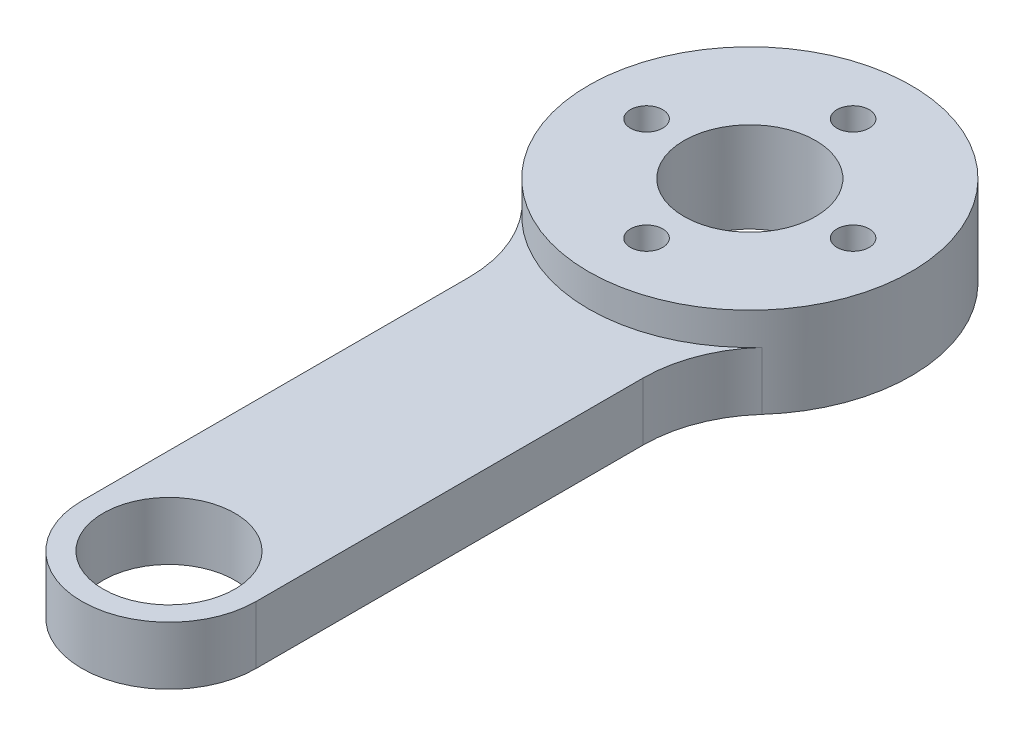
ISO-10303-21;
HEADER;
FILE_DESCRIPTION(('STEP AP214'),'2;1');
FILE_NAME('part.step','',(''),(''),'','','');
FILE_SCHEMA(('AUTOMOTIVE_DESIGN { 1 0 10303 214 1 1 1 1 }'));
ENDSEC;
DATA;
#1=APPLICATION_CONTEXT('core data for automotive mechanical design processes');
#2=APPLICATION_PROTOCOL_DEFINITION('international standard','automotive_design',2000,#1);
#3=PRODUCT_CONTEXT('',#1,'mechanical');
#4=PRODUCT('Part','Part','',(#3));
#5=PRODUCT_RELATED_PRODUCT_CATEGORY('part','',(#4));
#6=PRODUCT_DEFINITION_FORMATION('','',#4);
#7=PRODUCT_DEFINITION_CONTEXT('part definition',#1,'design');
#8=PRODUCT_DEFINITION('design','',#6,#7);
#9=PRODUCT_DEFINITION_SHAPE('','',#8);
#10=(LENGTH_UNIT() NAMED_UNIT(*) SI_UNIT(.MILLI.,.METRE.));
#11=(NAMED_UNIT(*) PLANE_ANGLE_UNIT() SI_UNIT($,.RADIAN.));
#12=(NAMED_UNIT(*) SI_UNIT($,.STERADIAN.) SOLID_ANGLE_UNIT());
#13=UNCERTAINTY_MEASURE_WITH_UNIT(LENGTH_MEASURE(1.E-05),#10,'distance_accuracy_value','');
#14=(GEOMETRIC_REPRESENTATION_CONTEXT(3) GLOBAL_UNCERTAINTY_ASSIGNED_CONTEXT((#13)) GLOBAL_UNIT_ASSIGNED_CONTEXT((#10,
#11,#12)) REPRESENTATION_CONTEXT('',''));
#15=CARTESIAN_POINT('',(0.,0.,0.));
#16=DIRECTION('',(0.,0.,1.));
#17=DIRECTION('',(1.,0.,0.));
#18=AXIS2_PLACEMENT_3D('',#15,#16,#17);
#19=CARTESIAN_POINT('',(0.,4.5,-8.));
#20=DIRECTION('',(0.,-1.,0.));
#21=DIRECTION('',(0.,0.,-1.));
#22=AXIS2_PLACEMENT_3D('',#19,#20,#21);
#23=CYLINDRICAL_SURFACE('',#22,1.25);
#24=CARTESIAN_POINT('',(0.,2.,-8.));
#25=DIRECTION('',(0.,-1.,0.));
#26=DIRECTION('',(0.,0.,-1.));
#27=AXIS2_PLACEMENT_3D('',#24,#25,#26);
#28=CIRCLE('',#27,1.25);
#29=CARTESIAN_POINT('',(0.,2.,-9.25));
#30=VERTEX_POINT('',#29);
#31=EDGE_CURVE('E138',#30,#30,#28,.T.);
#32=ORIENTED_EDGE('',*,*,#31,.T.);
#33=EDGE_LOOP('',(#32));
#34=FACE_BOUND('',#33,.T.);
#35=CARTESIAN_POINT('',(0.,7.,-8.));
#36=DIRECTION('',(0.,1.,0.));
#37=DIRECTION('',(0.,0.,1.));
#38=AXIS2_PLACEMENT_3D('',#35,#36,#37);
#39=CIRCLE('',#38,1.25);
#40=CARTESIAN_POINT('',(0.,7.,-6.75));
#41=VERTEX_POINT('',#40);
#42=EDGE_CURVE('E208',#41,#41,#39,.T.);
#43=ORIENTED_EDGE('',*,*,#42,.T.);
#44=EDGE_LOOP('',(#43));
#45=FACE_BOUND('',#44,.T.);
#46=ADVANCED_FACE('F42',(#34,#45),#23,.F.);
#47=CARTESIAN_POINT('',(8.,4.5,0.));
#48=DIRECTION('',(0.,-1.,0.));
#49=DIRECTION('',(0.,0.,-1.));
#50=AXIS2_PLACEMENT_3D('',#47,#48,#49);
#51=CYLINDRICAL_SURFACE('',#50,1.25);
#52=CARTESIAN_POINT('',(8.,2.,0.));
#53=DIRECTION('',(0.,-1.,0.));
#54=DIRECTION('',(0.,0.,-1.));
#55=AXIS2_PLACEMENT_3D('',#52,#53,#54);
#56=CIRCLE('',#55,1.25);
#57=CARTESIAN_POINT('',(8.,2.,-1.24999999999997));
#58=VERTEX_POINT('',#57);
#59=EDGE_CURVE('E136',#58,#58,#56,.T.);
#60=ORIENTED_EDGE('',*,*,#59,.T.);
#61=EDGE_LOOP('',(#60));
#62=FACE_BOUND('',#61,.T.);
#63=CARTESIAN_POINT('',(8.,7.,0.));
#64=DIRECTION('',(0.,1.,0.));
#65=DIRECTION('',(0.,0.,1.));
#66=AXIS2_PLACEMENT_3D('',#63,#64,#65);
#67=CIRCLE('',#66,1.25);
#68=CARTESIAN_POINT('',(8.,7.,1.25000000000003));
#69=VERTEX_POINT('',#68);
#70=EDGE_CURVE('E205',#69,#69,#67,.T.);
#71=ORIENTED_EDGE('',*,*,#70,.T.);
#72=EDGE_LOOP('',(#71));
#73=FACE_BOUND('',#72,.T.);
#74=ADVANCED_FACE('F244',(#62,#73),#51,.F.);
#75=CARTESIAN_POINT('',(0.,4.5,8.));
#76=DIRECTION('',(0.,-1.,0.));
#77=DIRECTION('',(0.,0.,-1.));
#78=AXIS2_PLACEMENT_3D('',#75,#76,#77);
#79=CYLINDRICAL_SURFACE('',#78,1.25);
#80=CARTESIAN_POINT('',(0.,2.,8.));
#81=DIRECTION('',(0.,-1.,0.));
#82=DIRECTION('',(0.,0.,-1.));
#83=AXIS2_PLACEMENT_3D('',#80,#81,#82);
#84=CIRCLE('',#83,1.25);
#85=CARTESIAN_POINT('',(0.,2.,6.75));
#86=VERTEX_POINT('',#85);
#87=EDGE_CURVE('E132',#86,#86,#84,.T.);
#88=ORIENTED_EDGE('',*,*,#87,.T.);
#89=EDGE_LOOP('',(#88));
#90=FACE_BOUND('',#89,.T.);
#91=CARTESIAN_POINT('',(0.,7.,8.));
#92=DIRECTION('',(0.,1.,0.));
#93=DIRECTION('',(0.,0.,1.));
#94=AXIS2_PLACEMENT_3D('',#91,#92,#93);
#95=CIRCLE('',#94,1.25);
#96=CARTESIAN_POINT('',(0.,7.,9.25));
#97=VERTEX_POINT('',#96);
#98=EDGE_CURVE('E214',#97,#97,#95,.T.);
#99=ORIENTED_EDGE('',*,*,#98,.T.);
#100=EDGE_LOOP('',(#99));
#101=FACE_BOUND('',#100,.T.);
#102=ADVANCED_FACE('F241',(#90,#101),#79,.F.);
#103=CARTESIAN_POINT('',(-8.,4.5,0.));
#104=DIRECTION('',(0.,-1.,0.));
#105=DIRECTION('',(0.,0.,-1.));
#106=AXIS2_PLACEMENT_3D('',#103,#104,#105);
#107=CYLINDRICAL_SURFACE('',#106,1.25);
#108=CARTESIAN_POINT('',(-8.,2.,0.));
#109=DIRECTION('',(0.,-1.,0.));
#110=DIRECTION('',(0.,0.,-1.));
#111=AXIS2_PLACEMENT_3D('',#108,#109,#110);
#112=CIRCLE('',#111,1.25);
#113=CARTESIAN_POINT('',(-8.,2.,-1.25000000000008));
#114=VERTEX_POINT('',#113);
#115=EDGE_CURVE('E129',#114,#114,#112,.T.);
#116=ORIENTED_EDGE('',*,*,#115,.T.);
#117=EDGE_LOOP('',(#116));
#118=FACE_BOUND('',#117,.T.);
#119=CARTESIAN_POINT('',(-8.,7.,0.));
#120=DIRECTION('',(0.,1.,0.));
#121=DIRECTION('',(0.,0.,1.));
#122=AXIS2_PLACEMENT_3D('',#119,#120,#121);
#123=CIRCLE('',#122,1.25);
#124=CARTESIAN_POINT('',(-8.,7.,1.24999999999992));
#125=VERTEX_POINT('',#124);
#126=EDGE_CURVE('E211',#125,#125,#123,.T.);
#127=ORIENTED_EDGE('',*,*,#126,.T.);
#128=EDGE_LOOP('',(#127));
#129=FACE_BOUND('',#128,.T.);
#130=ADVANCED_FACE('F243',(#118,#129),#107,.F.);
#131=CARTESIAN_POINT('',(-6.75,4.5,0.));
#132=DIRECTION('',(1.,0.,0.));
#133=DIRECTION('',(0.,0.,-1.));
#134=AXIS2_PLACEMENT_3D('',#131,#132,#133);
#135=PLANE('',#134);
#136=DIRECTION('',(0.,0.,1.));
#137=VECTOR('',#136,1.);
#138=CARTESIAN_POINT('',(-6.75,4.5,0.));
#139=LINE('',#138,#137);
#140=CARTESIAN_POINT('',(-6.75,4.5,15.0228991875736));
#141=VERTEX_POINT('',#140);
#142=CARTESIAN_POINT('',(-6.74999999999999,4.5,45.));
#143=VERTEX_POINT('',#142);
#144=EDGE_CURVE('E161',#141,#143,#139,.T.);
#145=ORIENTED_EDGE('',*,*,#144,.F.);
#146=DIRECTION('',(0.,1.,0.));
#147=VECTOR('',#146,1.);
#148=CARTESIAN_POINT('',(-6.75,0.,15.0228991875736));
#149=LINE('',#148,#147);
#150=CARTESIAN_POINT('',(-6.75,0.,15.0228991875736));
#151=VERTEX_POINT('',#150);
#152=EDGE_CURVE('E102',#141,#151,#149,.F.);
#153=ORIENTED_EDGE('',*,*,#152,.T.);
#154=DIRECTION('',(0.,0.,1.));
#155=VECTOR('',#154,1.);
#156=CARTESIAN_POINT('',(-6.75,0.,0.));
#157=LINE('',#156,#155);
#158=CARTESIAN_POINT('',(-6.74999999999999,0.,45.));
#159=VERTEX_POINT('',#158);
#160=EDGE_CURVE('E140',#151,#159,#157,.T.);
#161=ORIENTED_EDGE('',*,*,#160,.T.);
#162=DIRECTION('',(0.,-1.,0.));
#163=VECTOR('',#162,1.);
#164=CARTESIAN_POINT('',(-6.74999999999999,4.5,45.));
#165=LINE('',#164,#163);
#166=EDGE_CURVE('E165',#143,#159,#165,.T.);
#167=ORIENTED_EDGE('',*,*,#166,.F.);
#168=EDGE_LOOP('',(#145,#153,#161,#167));
#169=FACE_BOUND('',#168,.T.);
#170=ADVANCED_FACE('F168',(#169),#135,.F.);
#171=CARTESIAN_POINT('',(0.,4.5,45.));
#172=DIRECTION('',(0.,-1.,0.));
#173=DIRECTION('',(0.,0.,-1.));
#174=AXIS2_PLACEMENT_3D('',#171,#172,#173);
#175=CYLINDRICAL_SURFACE('',#174,6.75);
#176=CARTESIAN_POINT('',(0.,0.,45.));
#177=DIRECTION('',(0.,1.,0.));
#178=DIRECTION('',(0.,0.,1.));
#179=AXIS2_PLACEMENT_3D('',#176,#177,#178);
#180=CIRCLE('',#179,6.75);
#181=CARTESIAN_POINT('',(6.75,0.,45.));
#182=VERTEX_POINT('',#181);
#183=EDGE_CURVE('E143',#159,#182,#180,.T.);
#184=ORIENTED_EDGE('',*,*,#183,.T.);
#185=DIRECTION('',(0.,-1.,0.));
#186=VECTOR('',#185,1.);
#187=CARTESIAN_POINT('',(6.75,4.5,45.));
#188=LINE('',#187,#186);
#189=CARTESIAN_POINT('',(6.75,4.5,45.));
#190=VERTEX_POINT('',#189);
#191=EDGE_CURVE('E162',#190,#182,#188,.T.);
#192=ORIENTED_EDGE('',*,*,#191,.F.);
#193=CARTESIAN_POINT('',(0.,4.5,45.));
#194=DIRECTION('',(0.,1.,0.));
#195=DIRECTION('',(0.,0.,1.));
#196=AXIS2_PLACEMENT_3D('',#193,#194,#195);
#197=CIRCLE('',#196,6.75);
#198=EDGE_CURVE('E175',#143,#190,#197,.T.);
#199=ORIENTED_EDGE('',*,*,#198,.F.);
#200=ORIENTED_EDGE('',*,*,#166,.T.);
#201=EDGE_LOOP('',(#184,#192,#199,#200));
#202=FACE_BOUND('',#201,.T.);
#203=ADVANCED_FACE('F174',(#202),#175,.T.);
#204=CARTESIAN_POINT('',(6.75,4.5,0.));
#205=DIRECTION('',(1.,0.,0.));
#206=DIRECTION('',(0.,0.,-1.));
#207=AXIS2_PLACEMENT_3D('',#204,#205,#206);
#208=PLANE('',#207);
#209=DIRECTION('',(0.,0.,1.));
#210=VECTOR('',#209,1.);
#211=CARTESIAN_POINT('',(6.75,0.,0.));
#212=LINE('',#211,#210);
#213=CARTESIAN_POINT('',(6.75,0.,15.0228991875736));
#214=VERTEX_POINT('',#213);
#215=EDGE_CURVE('E150',#214,#182,#212,.T.);
#216=ORIENTED_EDGE('',*,*,#215,.F.);
#217=DIRECTION('',(0.,-1.,0.));
#218=VECTOR('',#217,1.);
#219=CARTESIAN_POINT('',(6.75,4.5,15.0228991875736));
#220=LINE('',#219,#218);
#221=CARTESIAN_POINT('',(6.75,4.5,15.0228991875736));
#222=VERTEX_POINT('',#221);
#223=EDGE_CURVE('E59',#214,#222,#220,.F.);
#224=ORIENTED_EDGE('',*,*,#223,.T.);
#225=DIRECTION('',(0.,0.,1.));
#226=VECTOR('',#225,1.);
#227=CARTESIAN_POINT('',(6.75,4.5,0.));
#228=LINE('',#227,#226);
#229=EDGE_CURVE('E109',#222,#190,#228,.T.);
#230=ORIENTED_EDGE('',*,*,#229,.T.);
#231=ORIENTED_EDGE('',*,*,#191,.T.);
#232=EDGE_LOOP('',(#216,#224,#230,#231));
#233=FACE_BOUND('',#232,.T.);
#234=ADVANCED_FACE('F371',(#233),#208,.T.);
#235=CARTESIAN_POINT('',(0.,4.5,0.));
#236=DIRECTION('',(0.,-1.,0.));
#237=DIRECTION('',(0.,0.,-1.));
#238=AXIS2_PLACEMENT_3D('',#235,#236,#237);
#239=CYLINDRICAL_SURFACE('',#238,12.5);
#240=CARTESIAN_POINT('',(0.,0.,0.));
#241=DIRECTION('',(0.,1.,0.));
#242=DIRECTION('',(0.,0.,1.));
#243=AXIS2_PLACEMENT_3D('',#240,#241,#242);
#244=CIRCLE('',#243,12.5);
#245=CARTESIAN_POINT('',(9.30555555555556,0.,8.34605510420757));
#246=VERTEX_POINT('',#245);
#247=CARTESIAN_POINT('',(-9.30555555555556,0.,8.34605510420757));
#248=VERTEX_POINT('',#247);
#249=EDGE_CURVE('E115',#246,#248,#244,.T.);
#250=ORIENTED_EDGE('',*,*,#249,.T.);
#251=DIRECTION('',(0.,-1.,0.));
#252=VECTOR('',#251,1.);
#253=CARTESIAN_POINT('',(-9.30555555555556,4.5,8.34605510420757));
#254=LINE('',#253,#252);
#255=CARTESIAN_POINT('',(-9.30555555555556,4.5,8.34605510420757));
#256=VERTEX_POINT('',#255);
#257=EDGE_CURVE('E101',#248,#256,#254,.F.);
#258=ORIENTED_EDGE('',*,*,#257,.T.);
#259=CARTESIAN_POINT('',(0.,4.5,0.));
#260=DIRECTION('',(0.,1.,0.));
#261=DIRECTION('',(0.,0.,1.));
#262=AXIS2_PLACEMENT_3D('',#259,#260,#261);
#263=CIRCLE('',#262,12.5);
#264=CARTESIAN_POINT('',(9.30555555555556,4.5,8.34605510420757));
#265=VERTEX_POINT('',#264);
#266=EDGE_CURVE('E11',#256,#265,#263,.T.);
#267=ORIENTED_EDGE('',*,*,#266,.T.);
#268=DIRECTION('',(0.,-1.,0.));
#269=VECTOR('',#268,1.);
#270=CARTESIAN_POINT('',(9.30555555555556,4.5,8.34605510420756));
#271=LINE('',#270,#269);
#272=EDGE_CURVE('E97',#265,#246,#271,.T.);
#273=ORIENTED_EDGE('',*,*,#272,.T.);
#274=EDGE_LOOP('',(#250,#258,#267,#273));
#275=FACE_BOUND('',#274,.T.);
#276=CARTESIAN_POINT('',(0.,7.,0.));
#277=DIRECTION('',(0.,1.,0.));
#278=DIRECTION('',(0.,0.,1.));
#279=AXIS2_PLACEMENT_3D('',#276,#277,#278);
#280=CIRCLE('',#279,12.5);
#281=CARTESIAN_POINT('',(0.,7.,12.5));
#282=VERTEX_POINT('',#281);
#283=EDGE_CURVE('E183',#282,#282,#280,.T.);
#284=ORIENTED_EDGE('',*,*,#283,.F.);
#285=EDGE_LOOP('',(#284));
#286=FACE_BOUND('',#285,.T.);
#287=ADVANCED_FACE('F111',(#275,#286),#239,.T.);
#288=CARTESIAN_POINT('',(0.,4.5,45.));
#289=DIRECTION('',(0.,-1.,0.));
#290=DIRECTION('',(0.,0.,-1.));
#291=AXIS2_PLACEMENT_3D('',#288,#289,#290);
#292=CYLINDRICAL_SURFACE('',#291,5.1);
#293=CARTESIAN_POINT('',(0.,4.5,45.));
#294=DIRECTION('',(0.,1.,0.));
#295=DIRECTION('',(0.,0.,1.));
#296=AXIS2_PLACEMENT_3D('',#293,#294,#295);
#297=CIRCLE('',#296,5.1);
#298=CARTESIAN_POINT('',(0.,4.5,50.1));
#299=VERTEX_POINT('',#298);
#300=EDGE_CURVE('E153',#299,#299,#297,.T.);
#301=ORIENTED_EDGE('',*,*,#300,.T.);
#302=EDGE_LOOP('',(#301));
#303=FACE_BOUND('',#302,.T.);
#304=CARTESIAN_POINT('',(0.,0.,45.));
#305=DIRECTION('',(0.,1.,0.));
#306=DIRECTION('',(0.,0.,1.));
#307=AXIS2_PLACEMENT_3D('',#304,#305,#306);
#308=CIRCLE('',#307,5.1);
#309=CARTESIAN_POINT('',(0.,0.,50.1));
#310=VERTEX_POINT('',#309);
#311=EDGE_CURVE('E158',#310,#310,#308,.T.);
#312=ORIENTED_EDGE('',*,*,#311,.F.);
#313=EDGE_LOOP('',(#312));
#314=FACE_BOUND('',#313,.T.);
#315=ADVANCED_FACE('F261',(#303,#314),#292,.F.);
#316=CARTESIAN_POINT('',(0.,4.5,0.));
#317=DIRECTION('',(0.,1.,0.));
#318=DIRECTION('',(0.,0.,1.));
#319=AXIS2_PLACEMENT_3D('',#316,#317,#318);
#320=PLANE('',#319);
#321=ORIENTED_EDGE('',*,*,#266,.F.);
#322=CARTESIAN_POINT('',(-16.75,4.5,15.0228991875736));
#323=DIRECTION('',(0.,1.,0.));
#324=DIRECTION('',(0.,0.,1.));
#325=AXIS2_PLACEMENT_3D('',#322,#323,#324);
#326=CIRCLE('',#325,10.);
#327=EDGE_CURVE('E119',#256,#141,#326,.F.);
#328=ORIENTED_EDGE('',*,*,#327,.T.);
#329=ORIENTED_EDGE('',*,*,#144,.T.);
#330=ORIENTED_EDGE('',*,*,#198,.T.);
#331=ORIENTED_EDGE('',*,*,#229,.F.);
#332=CARTESIAN_POINT('',(16.75,4.5,15.0228991875736));
#333=DIRECTION('',(0.,1.,0.));
#334=DIRECTION('',(0.,0.,1.));
#335=AXIS2_PLACEMENT_3D('',#332,#333,#334);
#336=CIRCLE('',#335,10.);
#337=EDGE_CURVE('E51',#222,#265,#336,.F.);
#338=ORIENTED_EDGE('',*,*,#337,.T.);
#339=EDGE_LOOP('',(#321,#328,#329,#330,#331,#338));
#340=FACE_BOUND('',#339,.T.);
#341=ORIENTED_EDGE('',*,*,#300,.F.);
#342=EDGE_LOOP('',(#341));
#343=FACE_BOUND('',#342,.T.);
#344=ADVANCED_FACE('F105',(#340,#343),#320,.T.);
#345=CARTESIAN_POINT('',(0.,0.,0.));
#346=DIRECTION('',(0.,1.,0.));
#347=DIRECTION('',(0.,0.,1.));
#348=AXIS2_PLACEMENT_3D('',#345,#346,#347);
#349=PLANE('',#348);
#350=CARTESIAN_POINT('',(0.,0.,0.));
#351=DIRECTION('',(0.,-1.,0.));
#352=DIRECTION('',(0.,0.,-1.));
#353=AXIS2_PLACEMENT_3D('',#350,#351,#352);
#354=CIRCLE('',#353,5.1);
#355=CARTESIAN_POINT('',(0.,0.,-5.1));
#356=VERTEX_POINT('',#355);
#357=EDGE_CURVE('E217',#356,#356,#354,.T.);
#358=ORIENTED_EDGE('',*,*,#357,.F.);
#359=EDGE_LOOP('',(#358));
#360=FACE_BOUND('',#359,.T.);
#361=CARTESIAN_POINT('',(0.,0.,8.));
#362=DIRECTION('',(0.,-1.,0.));
#363=DIRECTION('',(0.,0.,-1.));
#364=AXIS2_PLACEMENT_3D('',#361,#362,#363);
#365=CIRCLE('',#364,2.);
#366=CARTESIAN_POINT('',(0.,0.,6.));
#367=VERTEX_POINT('',#366);
#368=EDGE_CURVE('E198',#367,#367,#365,.T.);
#369=ORIENTED_EDGE('',*,*,#368,.F.);
#370=EDGE_LOOP('',(#369));
#371=FACE_BOUND('',#370,.T.);
#372=CARTESIAN_POINT('',(-8.,0.,0.));
#373=DIRECTION('',(0.,-1.,0.));
#374=DIRECTION('',(0.,0.,-1.));
#375=AXIS2_PLACEMENT_3D('',#372,#373,#374);
#376=CIRCLE('',#375,2.);
#377=CARTESIAN_POINT('',(-8.,0.,-2.00000000000008));
#378=VERTEX_POINT('',#377);
#379=EDGE_CURVE('E192',#378,#378,#376,.T.);
#380=ORIENTED_EDGE('',*,*,#379,.F.);
#381=EDGE_LOOP('',(#380));
#382=FACE_BOUND('',#381,.T.);
#383=CARTESIAN_POINT('',(8.,0.,0.));
#384=DIRECTION('',(0.,-1.,0.));
#385=DIRECTION('',(0.,0.,-1.));
#386=AXIS2_PLACEMENT_3D('',#383,#384,#385);
#387=CIRCLE('',#386,2.);
#388=CARTESIAN_POINT('',(8.,0.,-1.99999999999997));
#389=VERTEX_POINT('',#388);
#390=EDGE_CURVE('E186',#389,#389,#387,.T.);
#391=ORIENTED_EDGE('',*,*,#390,.F.);
#392=EDGE_LOOP('',(#391));
#393=FACE_BOUND('',#392,.T.);
#394=CARTESIAN_POINT('',(0.,0.,-8.));
#395=DIRECTION('',(0.,-1.,0.));
#396=DIRECTION('',(0.,0.,-1.));
#397=AXIS2_PLACEMENT_3D('',#394,#395,#396);
#398=CIRCLE('',#397,2.);
#399=CARTESIAN_POINT('',(0.,0.,-10.));
#400=VERTEX_POINT('',#399);
#401=EDGE_CURVE('E179',#400,#400,#398,.T.);
#402=ORIENTED_EDGE('',*,*,#401,.F.);
#403=EDGE_LOOP('',(#402));
#404=FACE_BOUND('',#403,.T.);
#405=ORIENTED_EDGE('',*,*,#160,.F.);
#406=CARTESIAN_POINT('',(-16.75,0.,15.0228991875736));
#407=DIRECTION('',(0.,1.,0.));
#408=DIRECTION('',(0.,0.,1.));
#409=AXIS2_PLACEMENT_3D('',#406,#407,#408);
#410=CIRCLE('',#409,10.);
#411=EDGE_CURVE('E123',#151,#248,#410,.T.);
#412=ORIENTED_EDGE('',*,*,#411,.T.);
#413=ORIENTED_EDGE('',*,*,#249,.F.);
#414=CARTESIAN_POINT('',(16.75,0.,15.0228991875736));
#415=DIRECTION('',(0.,1.,0.));
#416=DIRECTION('',(0.,0.,1.));
#417=AXIS2_PLACEMENT_3D('',#414,#415,#416);
#418=CIRCLE('',#417,10.);
#419=EDGE_CURVE('E67',#246,#214,#418,.T.);
#420=ORIENTED_EDGE('',*,*,#419,.T.);
#421=ORIENTED_EDGE('',*,*,#215,.T.);
#422=ORIENTED_EDGE('',*,*,#183,.F.);
#423=EDGE_LOOP('',(#405,#412,#413,#420,#421,#422));
#424=FACE_BOUND('',#423,.T.);
#425=ORIENTED_EDGE('',*,*,#311,.T.);
#426=EDGE_LOOP('',(#425));
#427=FACE_BOUND('',#426,.T.);
#428=ADVANCED_FACE('F169',(#360,#371,#382,#393,#404,#424,#427),#349,.F.);
#429=CARTESIAN_POINT('',(-16.75,4.5,15.0228991875736));
#430=DIRECTION('',(0.,-1.,0.));
#431=DIRECTION('',(0.,0.,-1.));
#432=AXIS2_PLACEMENT_3D('',#429,#430,#431);
#433=CYLINDRICAL_SURFACE('',#432,10.);
#434=ORIENTED_EDGE('',*,*,#327,.F.);
#435=ORIENTED_EDGE('',*,*,#257,.F.);
#436=ORIENTED_EDGE('',*,*,#411,.F.);
#437=ORIENTED_EDGE('',*,*,#152,.F.);
#438=EDGE_LOOP('',(#434,#435,#436,#437));
#439=FACE_BOUND('',#438,.T.);
#440=ADVANCED_FACE('F120',(#439),#433,.F.);
#441=CARTESIAN_POINT('',(16.75,4.5,15.0228991875736));
#442=DIRECTION('',(0.,-1.,0.));
#443=DIRECTION('',(0.,0.,-1.));
#444=AXIS2_PLACEMENT_3D('',#441,#442,#443);
#445=CYLINDRICAL_SURFACE('',#444,10.);
#446=ORIENTED_EDGE('',*,*,#337,.F.);
#447=ORIENTED_EDGE('',*,*,#223,.F.);
#448=ORIENTED_EDGE('',*,*,#419,.F.);
#449=ORIENTED_EDGE('',*,*,#272,.F.);
#450=EDGE_LOOP('',(#446,#447,#448,#449));
#451=FACE_BOUND('',#450,.T.);
#452=ADVANCED_FACE('F44',(#451),#445,.F.);
#453=CARTESIAN_POINT('',(0.,2.,-8.));
#454=DIRECTION('',(0.,-1.,0.));
#455=DIRECTION('',(0.,0.,-1.));
#456=AXIS2_PLACEMENT_3D('',#453,#454,#455);
#457=CYLINDRICAL_SURFACE('',#456,2.);
#458=CARTESIAN_POINT('',(0.,2.,-8.));
#459=DIRECTION('',(0.,-1.,0.));
#460=DIRECTION('',(0.,0.,-1.));
#461=AXIS2_PLACEMENT_3D('',#458,#459,#460);
#462=CIRCLE('',#461,2.);
#463=CARTESIAN_POINT('',(0.,2.,-10.));
#464=VERTEX_POINT('',#463);
#465=EDGE_CURVE('E182',#464,#464,#462,.T.);
#466=ORIENTED_EDGE('',*,*,#465,.F.);
#467=EDGE_LOOP('',(#466));
#468=FACE_BOUND('',#467,.T.);
#469=ORIENTED_EDGE('',*,*,#401,.T.);
#470=EDGE_LOOP('',(#469));
#471=FACE_BOUND('',#470,.T.);
#472=ADVANCED_FACE('F270',(#468,#471),#457,.F.);
#473=CARTESIAN_POINT('',(0.,2.,-8.));
#474=DIRECTION('',(0.,-1.,0.));
#475=DIRECTION('',(0.,0.,-1.));
#476=AXIS2_PLACEMENT_3D('',#473,#474,#475);
#477=PLANE('',#476);
#478=ORIENTED_EDGE('',*,*,#31,.F.);
#479=EDGE_LOOP('',(#478));
#480=FACE_BOUND('',#479,.T.);
#481=ORIENTED_EDGE('',*,*,#465,.T.);
#482=EDGE_LOOP('',(#481));
#483=FACE_BOUND('',#482,.T.);
#484=ADVANCED_FACE('F273',(#480,#483),#477,.T.);
#485=CARTESIAN_POINT('',(8.,2.,0.));
#486=DIRECTION('',(0.,-1.,0.));
#487=DIRECTION('',(0.,0.,-1.));
#488=AXIS2_PLACEMENT_3D('',#485,#486,#487);
#489=CYLINDRICAL_SURFACE('',#488,2.);
#490=CARTESIAN_POINT('',(8.,2.,0.));
#491=DIRECTION('',(0.,-1.,0.));
#492=DIRECTION('',(0.,0.,-1.));
#493=AXIS2_PLACEMENT_3D('',#490,#491,#492);
#494=CIRCLE('',#493,2.);
#495=CARTESIAN_POINT('',(8.,2.,-1.99999999999997));
#496=VERTEX_POINT('',#495);
#497=EDGE_CURVE('E189',#496,#496,#494,.T.);
#498=ORIENTED_EDGE('',*,*,#497,.F.);
#499=EDGE_LOOP('',(#498));
#500=FACE_BOUND('',#499,.T.);
#501=ORIENTED_EDGE('',*,*,#390,.T.);
#502=EDGE_LOOP('',(#501));
#503=FACE_BOUND('',#502,.T.);
#504=ADVANCED_FACE('F277',(#500,#503),#489,.F.);
#505=CARTESIAN_POINT('',(8.,2.,0.));
#506=DIRECTION('',(0.,-1.,0.));
#507=DIRECTION('',(0.,0.,-1.));
#508=AXIS2_PLACEMENT_3D('',#505,#506,#507);
#509=PLANE('',#508);
#510=ORIENTED_EDGE('',*,*,#59,.F.);
#511=EDGE_LOOP('',(#510));
#512=FACE_BOUND('',#511,.T.);
#513=ORIENTED_EDGE('',*,*,#497,.T.);
#514=EDGE_LOOP('',(#513));
#515=FACE_BOUND('',#514,.T.);
#516=ADVANCED_FACE('F281',(#512,#515),#509,.T.);
#517=CARTESIAN_POINT('',(-8.,2.,0.));
#518=DIRECTION('',(0.,-1.,0.));
#519=DIRECTION('',(0.,0.,-1.));
#520=AXIS2_PLACEMENT_3D('',#517,#518,#519);
#521=CYLINDRICAL_SURFACE('',#520,2.);
#522=CARTESIAN_POINT('',(-8.,2.,0.));
#523=DIRECTION('',(0.,-1.,0.));
#524=DIRECTION('',(0.,0.,-1.));
#525=AXIS2_PLACEMENT_3D('',#522,#523,#524);
#526=CIRCLE('',#525,2.);
#527=CARTESIAN_POINT('',(-8.,2.,-2.00000000000008));
#528=VERTEX_POINT('',#527);
#529=EDGE_CURVE('E195',#528,#528,#526,.T.);
#530=ORIENTED_EDGE('',*,*,#529,.F.);
#531=EDGE_LOOP('',(#530));
#532=FACE_BOUND('',#531,.T.);
#533=ORIENTED_EDGE('',*,*,#379,.T.);
#534=EDGE_LOOP('',(#533));
#535=FACE_BOUND('',#534,.T.);
#536=ADVANCED_FACE('F285',(#532,#535),#521,.F.);
#537=CARTESIAN_POINT('',(-8.,2.,0.));
#538=DIRECTION('',(0.,-1.,0.));
#539=DIRECTION('',(0.,0.,-1.));
#540=AXIS2_PLACEMENT_3D('',#537,#538,#539);
#541=PLANE('',#540);
#542=ORIENTED_EDGE('',*,*,#115,.F.);
#543=EDGE_LOOP('',(#542));
#544=FACE_BOUND('',#543,.T.);
#545=ORIENTED_EDGE('',*,*,#529,.T.);
#546=EDGE_LOOP('',(#545));
#547=FACE_BOUND('',#546,.T.);
#548=ADVANCED_FACE('F289',(#544,#547),#541,.T.);
#549=CARTESIAN_POINT('',(0.,2.,8.));
#550=DIRECTION('',(0.,-1.,0.));
#551=DIRECTION('',(0.,0.,-1.));
#552=AXIS2_PLACEMENT_3D('',#549,#550,#551);
#553=CYLINDRICAL_SURFACE('',#552,2.);
#554=CARTESIAN_POINT('',(0.,2.,8.));
#555=DIRECTION('',(0.,-1.,0.));
#556=DIRECTION('',(0.,0.,-1.));
#557=AXIS2_PLACEMENT_3D('',#554,#555,#556);
#558=CIRCLE('',#557,2.);
#559=CARTESIAN_POINT('',(0.,2.,6.));
#560=VERTEX_POINT('',#559);
#561=EDGE_CURVE('E133',#560,#560,#558,.T.);
#562=ORIENTED_EDGE('',*,*,#561,.F.);
#563=EDGE_LOOP('',(#562));
#564=FACE_BOUND('',#563,.T.);
#565=ORIENTED_EDGE('',*,*,#368,.T.);
#566=EDGE_LOOP('',(#565));
#567=FACE_BOUND('',#566,.T.);
#568=ADVANCED_FACE('F293',(#564,#567),#553,.F.);
#569=CARTESIAN_POINT('',(0.,2.,8.));
#570=DIRECTION('',(0.,-1.,0.));
#571=DIRECTION('',(0.,0.,-1.));
#572=AXIS2_PLACEMENT_3D('',#569,#570,#571);
#573=PLANE('',#572);
#574=ORIENTED_EDGE('',*,*,#87,.F.);
#575=EDGE_LOOP('',(#574));
#576=FACE_BOUND('',#575,.T.);
#577=ORIENTED_EDGE('',*,*,#561,.T.);
#578=EDGE_LOOP('',(#577));
#579=FACE_BOUND('',#578,.T.);
#580=ADVANCED_FACE('F229',(#576,#579),#573,.T.);
#581=CARTESIAN_POINT('',(0.,7.,0.));
#582=DIRECTION('',(0.,1.,0.));
#583=DIRECTION('',(0.,0.,1.));
#584=AXIS2_PLACEMENT_3D('',#581,#582,#583);
#585=PLANE('',#584);
#586=CARTESIAN_POINT('',(0.,7.,0.));
#587=DIRECTION('',(0.,1.,0.));
#588=DIRECTION('',(0.,0.,1.));
#589=AXIS2_PLACEMENT_3D('',#586,#587,#588);
#590=CIRCLE('',#589,5.1);
#591=CARTESIAN_POINT('',(0.,7.,5.1));
#592=VERTEX_POINT('',#591);
#593=EDGE_CURVE('E46',#592,#592,#590,.T.);
#594=ORIENTED_EDGE('',*,*,#593,.F.);
#595=EDGE_LOOP('',(#594));
#596=FACE_BOUND('',#595,.T.);
#597=ORIENTED_EDGE('',*,*,#126,.F.);
#598=EDGE_LOOP('',(#597));
#599=FACE_BOUND('',#598,.T.);
#600=ORIENTED_EDGE('',*,*,#70,.F.);
#601=EDGE_LOOP('',(#600));
#602=FACE_BOUND('',#601,.T.);
#603=ORIENTED_EDGE('',*,*,#283,.T.);
#604=EDGE_LOOP('',(#603));
#605=FACE_BOUND('',#604,.T.);
#606=ORIENTED_EDGE('',*,*,#42,.F.);
#607=EDGE_LOOP('',(#606));
#608=FACE_BOUND('',#607,.T.);
#609=ORIENTED_EDGE('',*,*,#98,.F.);
#610=EDGE_LOOP('',(#609));
#611=FACE_BOUND('',#610,.T.);
#612=ADVANCED_FACE('F226',(#596,#599,#602,#605,#608,#611),#585,.T.);
#613=CARTESIAN_POINT('',(0.,10.,0.));
#614=DIRECTION('',(0.,-1.,0.));
#615=DIRECTION('',(0.,0.,-1.));
#616=AXIS2_PLACEMENT_3D('',#613,#614,#615);
#617=CYLINDRICAL_SURFACE('',#616,5.1);
#618=ORIENTED_EDGE('',*,*,#593,.T.);
#619=EDGE_LOOP('',(#618));
#620=FACE_BOUND('',#619,.T.);
#621=ORIENTED_EDGE('',*,*,#357,.T.);
#622=EDGE_LOOP('',(#621));
#623=FACE_BOUND('',#622,.T.);
#624=ADVANCED_FACE('F224',(#620,#623),#617,.F.);
#625=CLOSED_SHELL('',(#46,#74,#102,#130,#170,#203,#234,#287,#315,#344,#428,#440,#452,#472,#484,
#504,#516,#536,#548,#568,#580,#612,#624));
#626=MANIFOLD_SOLID_BREP('B2',#625);
#627=ADVANCED_BREP_SHAPE_REPRESENTATION('',(#18,#626),#14);
#628=SHAPE_DEFINITION_REPRESENTATION(#9,#627);
ENDSEC;
END-ISO-10303-21;
